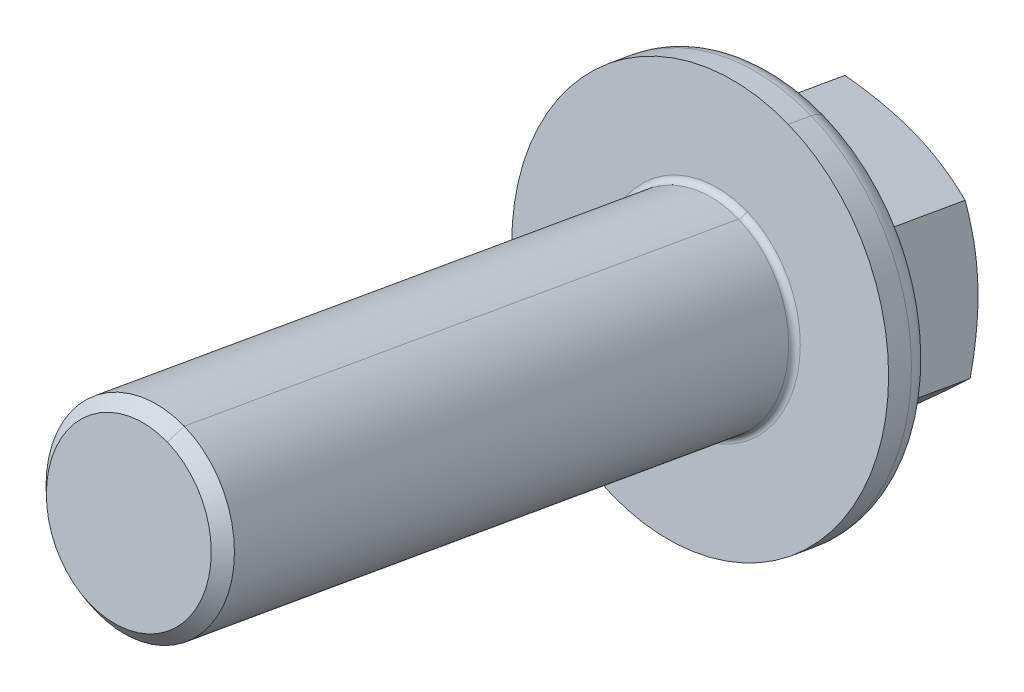
ISO-10303-21;
HEADER;
FILE_DESCRIPTION(('STEP AP214'),'2;1');
FILE_NAME('part.step','',(''),(''),'','','');
FILE_SCHEMA(('AUTOMOTIVE_DESIGN { 1 0 10303 214 1 1 1 1 }'));
ENDSEC;
DATA;
#1=APPLICATION_CONTEXT('core data for automotive mechanical design processes');
#2=APPLICATION_PROTOCOL_DEFINITION('international standard','automotive_design',2000,#1);
#3=PRODUCT_CONTEXT('',#1,'mechanical');
#4=PRODUCT('Part','Part','',(#3));
#5=PRODUCT_RELATED_PRODUCT_CATEGORY('part','',(#4));
#6=PRODUCT_DEFINITION_FORMATION('','',#4);
#7=PRODUCT_DEFINITION_CONTEXT('part definition',#1,'design');
#8=PRODUCT_DEFINITION('design','',#6,#7);
#9=PRODUCT_DEFINITION_SHAPE('','',#8);
#10=(LENGTH_UNIT() NAMED_UNIT(*) SI_UNIT(.MILLI.,.METRE.));
#11=(NAMED_UNIT(*) PLANE_ANGLE_UNIT() SI_UNIT($,.RADIAN.));
#12=(NAMED_UNIT(*) SI_UNIT($,.STERADIAN.) SOLID_ANGLE_UNIT());
#13=UNCERTAINTY_MEASURE_WITH_UNIT(LENGTH_MEASURE(1.E-05),#10,'distance_accuracy_value','');
#14=(GEOMETRIC_REPRESENTATION_CONTEXT(3) GLOBAL_UNCERTAINTY_ASSIGNED_CONTEXT((#13)) GLOBAL_UNIT_ASSIGNED_CONTEXT((#10,
#11,#12)) REPRESENTATION_CONTEXT('',''));
#15=CARTESIAN_POINT('',(0.,0.,0.));
#16=DIRECTION('',(0.,0.,1.));
#17=DIRECTION('',(1.,0.,0.));
#18=AXIS2_PLACEMENT_3D('',#15,#16,#17);
#19=CARTESIAN_POINT('',(49.998122241235,146.357522966761,-143.045914485197));
#20=DIRECTION('',(0.,-0.173648177667837,-0.984807753012048));
#21=DIRECTION('',(0.950853837155076,-0.304935953375422,0.0537684359684349));
#22=AXIS2_PLACEMENT_3D('',#19,#20,#21);
#23=TOROIDAL_SURFACE('',#22,4.25,0.25);
#24=CARTESIAN_POINT('',(49.998122241235,146.314110922344,-143.29211642345));
#25=DIRECTION('',(0.,0.173648177667837,0.984807753012048));
#26=DIRECTION('',(-0.950853837155076,0.304935953375421,-0.0537684359684347));
#27=AXIS2_PLACEMENT_3D('',#24,#25,#26);
#28=CIRCLE('',#27,4.25);
#29=CARTESIAN_POINT('',(51.3140925896424,150.293845903293,-143.993851076665));
#30=VERTEX_POINT('',#29);
#31=CARTESIAN_POINT('',(48.6821518928276,142.334375941394,-142.590381770236));
#32=VERTEX_POINT('',#31);
#33=EDGE_CURVE('E11',#30,#32,#28,.T.);
#34=ORIENTED_EDGE('',*,*,#33,.T.);
#35=CARTESIAN_POINT('',(48.6821518928276,142.377787985811,-142.344179831983));
#36=DIRECTION('',(0.950853837155076,-0.304935953375421,0.0537684359684348));
#37=DIRECTION('',(0.,-0.173648177667854,-0.984807753012045));
#38=AXIS2_PLACEMENT_3D('',#35,#36,#37);
#39=CIRCLE('',#38,0.25);
#40=CARTESIAN_POINT('',(48.7595619133222,142.611890043514,-142.385458340996));
#41=VERTEX_POINT('',#40);
#42=EDGE_CURVE('E33',#32,#41,#39,.T.);
#43=ORIENTED_EDGE('',*,*,#42,.T.);
#44=CARTESIAN_POINT('',(49.998122241235,146.357522966761,-143.045914485197));
#45=DIRECTION('',(0.,0.173648177667837,0.984807753012048));
#46=DIRECTION('',(-0.950853837155076,0.30493595337542,-0.0537684359684346));
#47=AXIS2_PLACEMENT_3D('',#44,#45,#46);
#48=CIRCLE('',#47,4.);
#49=CARTESIAN_POINT('',(51.2366825691478,150.103155890007,-143.706370629399));
#50=VERTEX_POINT('',#49);
#51=EDGE_CURVE('E461',#50,#41,#48,.T.);
#52=ORIENTED_EDGE('',*,*,#51,.F.);
#53=CARTESIAN_POINT('',(51.3140925896424,150.33725794771,-143.747649138412));
#54=DIRECTION('',(-0.950853837155076,0.304935953375422,-0.0537684359684348));
#55=DIRECTION('',(0.,-0.173648177667854,-0.984807753012045));
#56=AXIS2_PLACEMENT_3D('',#53,#54,#55);
#57=CIRCLE('',#56,0.25);
#58=EDGE_CURVE('E457',#30,#50,#57,.T.);
#59=ORIENTED_EDGE('',*,*,#58,.F.);
#60=EDGE_LOOP('',(#34,#43,#52,#59));
#61=FACE_BOUND('',#60,.T.);
#62=ADVANCED_FACE('F17',(#61),#23,.F.);
#63=CARTESIAN_POINT('',(49.998122241235,146.357522966761,-143.045914485197));
#64=DIRECTION('',(0.,-0.173648177667837,-0.984807753012048));
#65=DIRECTION('',(-0.309640081978204,-0.936408230811574,0.165114036050449));
#66=AXIS2_PLACEMENT_3D('',#63,#64,#65);
#67=TOROIDAL_SURFACE('',#66,4.25,0.25);
#68=CARTESIAN_POINT('',(49.998122241235,146.314110922344,-143.29211642345));
#69=DIRECTION('',(0.,0.173648177667837,0.984807753012048));
#70=DIRECTION('',(-0.950853837155076,0.304935953375421,-0.0537684359684347));
#71=AXIS2_PLACEMENT_3D('',#68,#69,#70);
#72=CIRCLE('',#71,4.25);
#73=EDGE_CURVE('E454',#32,#30,#72,.T.);
#74=ORIENTED_EDGE('',*,*,#73,.T.);
#75=ORIENTED_EDGE('',*,*,#58,.T.);
#76=CARTESIAN_POINT('',(49.998122241235,146.357522966761,-143.045914485197));
#77=DIRECTION('',(0.,0.173648177667837,0.984807753012048));
#78=DIRECTION('',(-0.950853837155076,0.30493595337542,-0.0537684359684346));
#79=AXIS2_PLACEMENT_3D('',#76,#77,#78);
#80=CIRCLE('',#79,4.);
#81=EDGE_CURVE('E465',#41,#50,#80,.T.);
#82=ORIENTED_EDGE('',*,*,#81,.F.);
#83=ORIENTED_EDGE('',*,*,#42,.F.);
#84=EDGE_LOOP('',(#74,#75,#82,#83));
#85=FACE_BOUND('',#84,.T.);
#86=ADVANCED_FACE('F311',(#85),#67,.F.);
#87=CARTESIAN_POINT('',(49.998122241235,148.484713143191,-130.9820195108));
#88=DIRECTION('',(0.,-0.173648177667837,-0.984807753012048));
#89=DIRECTION('',(0.950853837155076,-0.30493595337542,0.0537684359684346));
#90=AXIS2_PLACEMENT_3D('',#87,#88,#89);
#91=CYLINDRICAL_SURFACE('',#90,4.);
#92=DIRECTION('',(0.,0.173648177667837,0.984807753012048));
#93=VECTOR('',#92,1.);
#94=CARTESIAN_POINT('',(51.2366825691478,152.230346066438,-131.642475655002));
#95=LINE('',#94,#93);
#96=CARTESIAN_POINT('',(51.2366825691478,154.314124198452,-119.824782618857));
#97=VERTEX_POINT('',#96);
#98=EDGE_CURVE('E468',#50,#97,#95,.T.);
#99=ORIENTED_EDGE('',*,*,#98,.F.);
#100=ORIENTED_EDGE('',*,*,#51,.T.);
#101=DIRECTION('',(0.,0.173648177667837,0.984807753012048));
#102=VECTOR('',#101,1.);
#103=CARTESIAN_POINT('',(48.7595619133222,144.739080219945,-130.321563366598));
#104=LINE('',#103,#102);
#105=CARTESIAN_POINT('',(48.7595619133222,146.822858351959,-118.503870330453));
#106=VERTEX_POINT('',#105);
#107=EDGE_CURVE('E472',#41,#106,#104,.T.);
#108=ORIENTED_EDGE('',*,*,#107,.T.);
#109=CARTESIAN_POINT('',(49.998122241235,150.568491275206,-119.164326474655));
#110=DIRECTION('',(0.,-0.173648177667837,-0.984807753012048));
#111=DIRECTION('',(-0.950853837155076,0.30493595337542,-0.0537684359684345));
#112=AXIS2_PLACEMENT_3D('',#109,#110,#111);
#113=CIRCLE('',#112,4.);
#114=EDGE_CURVE('E467',#106,#97,#113,.T.);
#115=ORIENTED_EDGE('',*,*,#114,.T.);
#116=EDGE_LOOP('',(#99,#100,#108,#115));
#117=FACE_BOUND('',#116,.T.);
#118=ADVANCED_FACE('F317',(#117),#91,.T.);
#119=CARTESIAN_POINT('',(49.998122241235,148.484713143191,-130.9820195108));
#120=DIRECTION('',(0.,-0.173648177667837,-0.984807753012048));
#121=DIRECTION('',(0.950853837155076,-0.30493595337542,0.0537684359684346));
#122=AXIS2_PLACEMENT_3D('',#119,#120,#121);
#123=CYLINDRICAL_SURFACE('',#122,4.);
#124=ORIENTED_EDGE('',*,*,#107,.F.);
#125=ORIENTED_EDGE('',*,*,#81,.T.);
#126=ORIENTED_EDGE('',*,*,#98,.T.);
#127=CARTESIAN_POINT('',(49.998122241235,150.568491275206,-119.164326474655));
#128=DIRECTION('',(0.,-0.173648177667837,-0.984807753012048));
#129=DIRECTION('',(-0.950853837155076,0.30493595337542,-0.0537684359684345));
#130=AXIS2_PLACEMENT_3D('',#127,#128,#129);
#131=CIRCLE('',#130,4.);
#132=EDGE_CURVE('E471',#97,#106,#131,.T.);
#133=ORIENTED_EDGE('',*,*,#132,.T.);
#134=EDGE_LOOP('',(#124,#125,#126,#133));
#135=FACE_BOUND('',#134,.T.);
#136=ADVANCED_FACE('F322',(#135),#123,.T.);
#137=CARTESIAN_POINT('',(49.9981222412351,151.263083985877,-115.225095462607));
#138=DIRECTION('',(0.,-0.173648177667833,-0.984807753012049));
#139=DIRECTION('',(-0.0369243923365254,-0.984136175286614,0.173529760395196));
#140=AXIS2_PLACEMENT_3D('',#137,#138,#139);
#141=CONICAL_SURFACE('',#140,0.,0.785398163396999);
#142=DIRECTION('',(0.218948438976632,0.784928466118314,0.579610976558283));
#143=VECTOR('',#142,1.);
#144=CARTESIAN_POINT('',(48.8369727967557,147.100372177337,-118.298946852416));
#145=LINE('',#144,#143);
#146=CARTESIAN_POINT('',(48.9143822034284,147.377886476308,-118.094023457886));
#147=VERTEX_POINT('',#146);
#148=EDGE_CURVE('E478',#106,#147,#145,.T.);
#149=ORIENTED_EDGE('',*,*,#148,.T.);
#150=CARTESIAN_POINT('',(49.998122241235,150.65531536404,-118.671922598149));
#151=DIRECTION('',(0.,-0.173648177667837,-0.984807753012048));
#152=DIRECTION('',(0.999318062105632,-0.036363427848566,0.00641185344076513));
#153=AXIS2_PLACEMENT_3D('',#150,#151,#152);
#154=CIRCLE('',#153,3.5);
#155=CARTESIAN_POINT('',(51.0818625281587,153.93274417188,-119.249821724326));
#156=VERTEX_POINT('',#155);
#157=EDGE_CURVE('E481',#147,#156,#154,.T.);
#158=ORIENTED_EDGE('',*,*,#157,.T.);
#159=DIRECTION('',(-0.218948601693932,-0.539352805996153,0.813117494880259));
#160=VECTOR('',#159,1.);
#161=CARTESIAN_POINT('',(51.1592725486533,154.123434185166,-119.537302171591));
#162=LINE('',#161,#160);
#163=EDGE_CURVE('E484',#97,#156,#162,.T.);
#164=ORIENTED_EDGE('',*,*,#163,.F.);
#165=ORIENTED_EDGE('',*,*,#114,.F.);
#166=EDGE_LOOP('',(#149,#158,#164,#165));
#167=FACE_BOUND('',#166,.T.);
#168=ADVANCED_FACE('F326',(#167),#141,.T.);
#169=CARTESIAN_POINT('',(49.9981222412359,151.263083985876,-115.225095462607));
#170=DIRECTION('',(-2.29886375447954E-13,-0.173648177667559,-0.984807753012097));
#171=DIRECTION('',(0.309640081978204,0.936408230811608,-0.165114036050255));
#172=AXIS2_PLACEMENT_3D('',#169,#170,#171);
#173=CONICAL_SURFACE('',#172,0.,0.785398163396999);
#174=ORIENTED_EDGE('',*,*,#163,.T.);
#175=CARTESIAN_POINT('',(49.9981222412351,150.655315364039,-118.67192259815));
#176=DIRECTION('',(-2.90939847236384E-13,-0.173648177667744,-0.984807753012065));
#177=DIRECTION('',(0.950853837155077,-0.304935953375472,0.0537684359681331));
#178=AXIS2_PLACEMENT_3D('',#175,#176,#177);
#179=CIRCLE('',#178,3.5);
#180=EDGE_CURVE('E352',#156,#147,#179,.T.);
#181=ORIENTED_EDGE('',*,*,#180,.T.);
#182=ORIENTED_EDGE('',*,*,#148,.F.);
#183=ORIENTED_EDGE('',*,*,#132,.F.);
#184=EDGE_LOOP('',(#174,#181,#182,#183));
#185=FACE_BOUND('',#184,.T.);
#186=ADVANCED_FACE('F330',(#185),#173,.T.);
#187=CARTESIAN_POINT('',(49.998122241235,150.65531536404,-118.671922598149));
#188=DIRECTION('',(0.,-0.173648177667837,-0.984807753012048));
#189=DIRECTION('',(-0.309640081978204,-0.936408230811574,0.165114036050449));
#190=AXIS2_PLACEMENT_3D('',#187,#188,#189);
#191=PLANE('',#190);
#192=ORIENTED_EDGE('',*,*,#180,.F.);
#193=ORIENTED_EDGE('',*,*,#157,.F.);
#194=EDGE_LOOP('',(#192,#193));
#195=FACE_BOUND('',#194,.T.);
#196=ADVANCED_FACE('F334',(#195),#191,.F.);
#197=CARTESIAN_POINT('',(49.998122241235,145.098573678669,-150.185770694534));
#198=DIRECTION('',(0.,-0.173648177667837,-0.984807753012048));
#199=DIRECTION('',(0.950853837155076,-0.304935953375421,0.0537684359684347));
#200=AXIS2_PLACEMENT_3D('',#197,#198,#199);
#201=PLANE('',#200);
#202=CARTESIAN_POINT('',(49.998122241235,145.098573678669,-150.185770694534));
#203=DIRECTION('',(0.,-0.173648177667837,-0.984807753012048));
#204=DIRECTION('',(-0.950853837155075,0.304935953375424,-0.0537684359684351));
#205=AXIS2_PLACEMENT_3D('',#202,#203,#204);
#206=CIRCLE('',#205,5.);
#207=CARTESIAN_POINT('',(54.8895403374926,146.119182844947,-150.365731627307));
#208=VERTEX_POINT('',#207);
#209=CARTESIAN_POINT('',(53.3413399276004,141.437141690886,-149.540161447054));
#210=VERTEX_POINT('',#209);
#211=EDGE_CURVE('E347',#208,#210,#206,.T.);
#212=ORIENTED_EDGE('',*,*,#211,.T.);
#213=CARTESIAN_POINT('',(49.998122241235,145.098573678669,-150.185770694534));
#214=DIRECTION('',(0.,-0.173648177667837,-0.984807753012048));
#215=DIRECTION('',(-0.950853837155075,0.304935953375424,-0.0537684359684351));
#216=AXIS2_PLACEMENT_3D('',#213,#214,#215);
#217=CIRCLE('',#216,5.);
#218=CARTESIAN_POINT('',(48.4499218313441,140.416532524611,-149.360200514282));
#219=VERTEX_POINT('',#218);
#220=EDGE_CURVE('E353',#210,#219,#217,.T.);
#221=ORIENTED_EDGE('',*,*,#220,.T.);
#222=CARTESIAN_POINT('',(49.998122241235,145.098573678669,-150.185770694534));
#223=DIRECTION('',(0.,-0.173648177667837,-0.984807753012048));
#224=DIRECTION('',(-0.950853837155075,0.304935953375424,-0.0537684359684351));
#225=AXIS2_PLACEMENT_3D('',#222,#223,#224);
#226=CIRCLE('',#225,5.);
#227=CARTESIAN_POINT('',(46.3601304941449,141.72066642625,-149.590154507599));
#228=VERTEX_POINT('',#227);
#229=EDGE_CURVE('E368',#219,#228,#226,.T.);
#230=ORIENTED_EDGE('',*,*,#229,.T.);
#231=CARTESIAN_POINT('',(49.998122241235,145.098573678669,-150.185770694534));
#232=DIRECTION('',(0.,-0.173648177667837,-0.984807753012048));
#233=DIRECTION('',(-0.950853837155075,0.304935953375424,-0.0537684359684351));
#234=AXIS2_PLACEMENT_3D('',#231,#232,#233);
#235=CIRCLE('',#234,5.);
#236=CARTESIAN_POINT('',(45.1067041449777,144.07796451239,-150.005809761759));
#237=VERTEX_POINT('',#236);
#238=EDGE_CURVE('E372',#228,#237,#235,.T.);
#239=ORIENTED_EDGE('',*,*,#238,.T.);
#240=CARTESIAN_POINT('',(49.998122241235,145.098573678669,-150.185770694534));
#241=DIRECTION('',(0.,-0.173648177667837,-0.984807753012048));
#242=DIRECTION('',(-0.950853837155075,0.304935953375424,-0.0537684359684351));
#243=AXIS2_PLACEMENT_3D('',#240,#241,#242);
#244=CIRCLE('',#243,5.);
#245=CARTESIAN_POINT('',(46.6549045548693,148.760005666451,-150.831379942012));
#246=VERTEX_POINT('',#245);
#247=EDGE_CURVE('E172',#237,#246,#244,.T.);
#248=ORIENTED_EDGE('',*,*,#247,.T.);
#249=CARTESIAN_POINT('',(49.998122241235,145.098573678669,-150.185770694534));
#250=DIRECTION('',(0.,-0.173648177667837,-0.984807753012048));
#251=DIRECTION('',(-0.950853837155075,0.304935953375424,-0.0537684359684351));
#252=AXIS2_PLACEMENT_3D('',#249,#250,#251);
#253=CIRCLE('',#252,5.);
#254=CARTESIAN_POINT('',(51.546322651126,149.780614832727,-151.011340874786));
#255=VERTEX_POINT('',#254);
#256=EDGE_CURVE('E147',#246,#255,#253,.T.);
#257=ORIENTED_EDGE('',*,*,#256,.T.);
#258=CARTESIAN_POINT('',(49.998122241235,145.098573678669,-150.185770694534));
#259=DIRECTION('',(0.,-0.173648177667837,-0.984807753012048));
#260=DIRECTION('',(-0.950853837155075,0.304935953375424,-0.0537684359684351));
#261=AXIS2_PLACEMENT_3D('',#258,#259,#260);
#262=CIRCLE('',#261,5.);
#263=CARTESIAN_POINT('',(53.6361139883251,148.476480931088,-150.78138688147));
#264=VERTEX_POINT('',#263);
#265=EDGE_CURVE('E160',#255,#264,#262,.T.);
#266=ORIENTED_EDGE('',*,*,#265,.T.);
#267=CARTESIAN_POINT('',(49.998122241235,145.098573678669,-150.185770694534));
#268=DIRECTION('',(0.,-0.173648177667837,-0.984807753012048));
#269=DIRECTION('',(-0.950853837155075,0.304935953375424,-0.0537684359684351));
#270=AXIS2_PLACEMENT_3D('',#267,#268,#269);
#271=CIRCLE('',#270,5.);
#272=EDGE_CURVE('E166',#264,#208,#271,.T.);
#273=ORIENTED_EDGE('',*,*,#272,.T.);
#274=EDGE_LOOP('',(#212,#221,#230,#239,#248,#257,#266,#273));
#275=FACE_BOUND('',#274,.T.);
#276=ADVANCED_FACE('F169',(#275),#201,.T.);
#277=CARTESIAN_POINT('',(49.998122241235,145.098573678669,-150.185770694534));
#278=DIRECTION('',(0.,0.173648177667837,0.984807753012048));
#279=DIRECTION('',(0.727598349418324,0.675581450484054,-0.11912323738714));
#280=AXIS2_PLACEMENT_3D('',#277,#278,#279);
#281=CONICAL_SURFACE('',#280,5.,1.0471975512);
#282=ORIENTED_EDGE('',*,*,#211,.F.);
#283=CARTESIAN_POINT('',(55.4878794296533,143.415573279286,-149.435541081199));
#284=CARTESIAN_POINT('',(55.4391748824888,143.630176304098,-149.542278075946));
#285=CARTESIAN_POINT('',(55.3900802918084,143.84757993513,-149.643733599582));
#286=CARTESIAN_POINT('',(55.2914583464846,144.286951808943,-149.832520163997));
#287=CARTESIAN_POINT('',(55.2419344318635,144.508891437683,-149.919919981723));
#288=CARTESIAN_POINT('',(55.1671811743695,144.846219825367,-150.038662375499));
#289=CARTESIAN_POINT('',(55.1421689925106,144.959474723572,-150.076204144338));
#290=CARTESIAN_POINT('',(55.0920248852829,145.187349376973,-150.146801875159));
#291=CARTESIAN_POINT('',(55.0668929630833,145.301969096166,-150.179857955192));
#292=CARTESIAN_POINT('',(55.0164164153042,145.533044077326,-150.241341607244));
#293=CARTESIAN_POINT('',(54.9910713552905,145.649505665294,-150.269745110845));
#294=CARTESIAN_POINT('',(54.9403313897386,145.883550894626,-150.321543460521));
#295=CARTESIAN_POINT('',(54.9149364753252,146.001134753577,-150.344937313831));
#296=CARTESIAN_POINT('',(54.8895403374938,146.119182844947,-150.365731627307));
#297=B_SPLINE_CURVE_WITH_KNOTS('',3,(#283,#284,#285,#286,#287,#288,#289,#290,#291,#292,#293,
#294,#295,#296),.UNSPECIFIED.,.F.,.F.,(4,2,2,2,2,2,4),(0.,0.734036658391423,1.46436443241669,
1.83000749078334,2.19564092445815,2.56310985866669,2.9306515471674),.UNSPECIFIED.);
#298=CARTESIAN_POINT('',(55.4878794296539,143.415573279287,-149.435541081199));
#299=VERTEX_POINT('',#298);
#300=EDGE_CURVE('E218',#299,#208,#297,.T.);
#301=ORIENTED_EDGE('',*,*,#300,.F.);
#302=CARTESIAN_POINT('',(53.3413399276015,141.437141690885,-149.540161447053));
#303=CARTESIAN_POINT('',(53.4324484875621,141.517819980658,-149.554407956351));
#304=CARTESIAN_POINT('',(53.5235526585145,141.598952929526,-149.56605323778));
#305=CARTESIAN_POINT('',(53.7055821160863,141.76195113256,-149.584264357744));
#306=CARTESIAN_POINT('',(53.7965074345459,141.843816238587,-149.59083120129));
#307=CARTESIAN_POINT('',(53.9775918817345,142.007723429098,-149.598993563003));
#308=CARTESIAN_POINT('',(54.067752568995,142.089762587056,-149.600613749007));
#309=CARTESIAN_POINT('',(54.2476443868121,142.254268737032,-149.599203340534));
#310=CARTESIAN_POINT('',(54.3373755059988,142.336735740256,-149.596172623632));
#311=CARTESIAN_POINT('',(54.6055525685049,142.584356309733,-149.580572513342));
#312=CARTESIAN_POINT('',(54.7832194474093,142.749944438086,-149.561504294965));
#313=CARTESIAN_POINT('',(55.1370253480783,143.082295509926,-149.508793307502));
#314=CARTESIAN_POINT('',(55.3131520287741,143.24906014906,-149.475077015028));
#315=CARTESIAN_POINT('',(55.4878794296545,143.415573279288,-149.435541081199));
#316=B_SPLINE_CURVE_WITH_KNOTS('',3,(#302,#303,#304,#305,#306,#307,#308,#309,#310,#311,#312,
#313,#314,#315),.UNSPECIFIED.,.F.,.F.,(4,2,2,2,2,2,4),(0.,0.367541688500857,0.735010622709555,
1.10064405638448,1.46628711475125,2.19661488877674,2.93065154716842),.UNSPECIFIED.);
#317=EDGE_CURVE('E234',#210,#299,#316,.T.);
#318=ORIENTED_EDGE('',*,*,#317,.F.);
#319=EDGE_LOOP('',(#282,#301,#318));
#320=FACE_BOUND('',#319,.T.);
#321=ADVANCED_FACE('F248',(#320),#281,.T.);
#322=CARTESIAN_POINT('',(49.998122241235,145.098573678669,-150.185770694534));
#323=DIRECTION('',(0.,0.173648177667837,0.984807753012048));
#324=DIRECTION('',(0.727598349418324,0.675581450484054,-0.11912323738714));
#325=AXIS2_PLACEMENT_3D('',#322,#323,#324);
#326=CONICAL_SURFACE('',#325,5.,1.0471975512);
#327=ORIENTED_EDGE('',*,*,#220,.F.);
#328=CARTESIAN_POINT('',(51.194800425553,139.613806399063,-148.76518700585));
#329=CARTESIAN_POINT('',(51.369527826433,139.756755473047,-148.859289475791));
#330=CARTESIAN_POINT('',(51.5456545071284,139.901931322665,-148.948009292807));
#331=CARTESIAN_POINT('',(51.8994604077967,140.196210952895,-149.111212179986));
#332=CARTESIAN_POINT('',(52.0771272867007,140.345291180416,-149.185764919478));
#333=CARTESIAN_POINT('',(52.3453043492062,140.572642850349,-149.285115450664));
#334=CARTESIAN_POINT('',(52.4350354683927,140.649099918508,-149.316168769235));
#335=CARTESIAN_POINT('',(52.6149272862094,140.803202745606,-149.373758536662));
#336=CARTESIAN_POINT('',(52.7050879734697,140.880848473204,-149.400295104393));
#337=CARTESIAN_POINT('',(52.886172420658,141.037662542743,-149.448684554114));
#338=CARTESIAN_POINT('',(52.9770977391173,141.116836571548,-149.470513254989));
#339=CARTESIAN_POINT('',(53.1591271966888,141.276233349999,-149.509149068707));
#340=CARTESIAN_POINT('',(53.250231367641,141.356456304177,-149.525955186481));
#341=CARTESIAN_POINT('',(53.3413399276015,141.437141690885,-149.540161447053));
#342=B_SPLINE_CURVE_WITH_KNOTS('',3,(#328,#329,#330,#331,#332,#333,#334,#335,#336,#337,#338,
#339,#340,#341),.UNSPECIFIED.,.F.,.F.,(4,2,2,2,2,2,4),(0.,0.734036658390082,1.46436443241398,
1.83000749077993,2.19564092445406,2.56310985866195,2.93065154716203),.UNSPECIFIED.);
#343=CARTESIAN_POINT('',(51.1948004255538,139.613806399064,-148.76518700585));
#344=VERTEX_POINT('',#343);
#345=EDGE_CURVE('E225',#344,#210,#342,.T.);
#346=ORIENTED_EDGE('',*,*,#345,.F.);
#347=CARTESIAN_POINT('',(48.4499218313441,140.416532524611,-149.360200514282));
#348=CARTESIAN_POINT('',(48.5664265291361,140.379166271482,-149.353632585741));
#349=CARTESIAN_POINT('',(48.6829256145018,140.342260364054,-149.344464432033));
#350=CARTESIAN_POINT('',(48.9156950376253,140.269412625465,-149.321089549197));
#351=CARTESIAN_POINT('',(49.0319654160985,140.233470604912,-149.306883817807));
#352=CARTESIAN_POINT('',(49.2635264110661,140.162756253777,-149.273676071472));
#353=CARTESIAN_POINT('',(49.3788190205261,140.127978977363,-149.254698368306));
#354=CARTESIAN_POINT('',(49.6088549455707,140.059408812499,-149.212190316963));
#355=CARTESIAN_POINT('',(49.7235982466163,140.025615949986,-149.188659848958));
#356=CARTESIAN_POINT('',(50.066528566616,139.925773682007,-149.11179266563));
#357=CARTESIAN_POINT('',(50.2937193601413,139.861168231204,-149.052135108463));
#358=CARTESIAN_POINT('',(50.7461472061338,139.735111708426,-148.918594493906));
#359=CARTESIAN_POINT('',(50.9713684775098,139.67367832177,-148.844640732541));
#360=CARTESIAN_POINT('',(51.1948004255545,139.613806399064,-148.76518700585));
#361=B_SPLINE_CURVE_WITH_KNOTS('',3,(#347,#348,#349,#350,#351,#352,#353,#354,#355,#356,#357,
#358,#359,#360),.UNSPECIFIED.,.F.,.F.,(4,2,2,2,2,2,4),(0.,0.36754168850069,0.735010622709175,
1.10064405638397,1.46628711475054,2.19661488877568,2.930651547167),.UNSPECIFIED.);
#362=EDGE_CURVE('E256',#219,#344,#361,.T.);
#363=ORIENTED_EDGE('',*,*,#362,.F.);
#364=EDGE_LOOP('',(#327,#346,#363));
#365=FACE_BOUND('',#364,.T.);
#366=ADVANCED_FACE('F243',(#365),#326,.T.);
#367=CARTESIAN_POINT('',(49.998122241235,145.098573678669,-150.185770694534));
#368=DIRECTION('',(0.,0.173648177667837,0.984807753012048));
#369=DIRECTION('',(0.727598349418324,0.675581450484054,-0.11912323738714));
#370=AXIS2_PLACEMENT_3D('',#367,#368,#369);
#371=CONICAL_SURFACE('',#370,5.,1.0471975512);
#372=DIRECTION('',(0.630118654347753,0.49824660961079,-0.595567626264499));
#373=VECTOR('',#372,1.);
#374=CARTESIAN_POINT('',(44.7368460928394,140.437105078229,-148.055878969265));
#375=LINE('',#374,#373);
#376=CARTESIAN_POINT('',(45.8526527377652,141.319394269292,-149.110503063145));
#377=VERTEX_POINT('',#376);
#378=EDGE_CURVE('E359',#377,#228,#375,.T.);
#379=ORIENTED_EDGE('',*,*,#378,.T.);
#380=ORIENTED_EDGE('',*,*,#229,.F.);
#381=CARTESIAN_POINT('',(45.8526527377646,141.319394269295,-149.110503063129));
#382=CARTESIAN_POINT('',(46.0644357983107,141.240765765312,-149.159268475625));
#383=CARTESIAN_POINT('',(46.2778240206991,141.162557079677,-149.202642803138));
#384=CARTESIAN_POINT('',(46.7063596997772,141.00792932147,-149.275942947605));
#385=CARTESIAN_POINT('',(46.9214943172372,140.931503605573,-149.305930518277));
#386=CARTESIAN_POINT('',(47.2460346538946,140.818319847472,-149.339213613791));
#387=CARTESIAN_POINT('',(47.3545818044383,140.780814026044,-149.348360088141));
#388=CARTESIAN_POINT('',(47.572146248573,140.706380997244,-149.362489889284));
#389=CARTESIAN_POINT('',(47.6811635332149,140.669453778919,-149.367473294974));
#390=CARTESIAN_POINT('',(47.9000400707925,140.596089853949,-149.373079324417));
#391=CARTESIAN_POINT('',(48.0099008840012,140.559656215164,-149.373681623476));
#392=CARTESIAN_POINT('',(48.2298136331932,140.487523424747,-149.370362323418));
#393=CARTESIAN_POINT('',(48.3398655966701,140.451824390258,-149.366440008384));
#394=CARTESIAN_POINT('',(48.4499218313441,140.416532524611,-149.360200514282));
#395=B_SPLINE_CURVE_WITH_KNOTS('',3,(#381,#382,#383,#384,#385,#386,#387,#388,#389,#390,#391,
#392,#393,#394),.UNSPECIFIED.,.F.,.F.,(4,2,2,2,2,2,4),(0.,0.693572709725118,1.38391201165248,
1.72946469135565,2.07501082206913,2.42215898329262,2.7693620802703),.UNSPECIFIED.);
#396=EDGE_CURVE('E262',#377,#219,#395,.T.);
#397=ORIENTED_EDGE('',*,*,#396,.F.);
#398=EDGE_LOOP('',(#379,#380,#397));
#399=FACE_BOUND('',#398,.T.);
#400=ADVANCED_FACE('F247',(#399),#371,.T.);
#401=CARTESIAN_POINT('',(49.998122241235,145.098573678669,-150.185770694534));
#402=DIRECTION('',(0.,0.173648177667837,0.984807753012048));
#403=DIRECTION('',(0.727598349418324,0.675581450484054,-0.11912323738714));
#404=AXIS2_PLACEMENT_3D('',#401,#402,#403);
#405=CONICAL_SURFACE('',#404,5.,1.0471975512);
#406=ORIENTED_EDGE('',*,*,#238,.F.);
#407=ORIENTED_EDGE('',*,*,#378,.F.);
#408=CARTESIAN_POINT('',(45.8526527377663,141.319394269302,-149.110503063083));
#409=CARTESIAN_POINT('',(45.8040875345662,141.337423930787,-149.09932660615));
#410=CARTESIAN_POINT('',(45.7549017335225,141.355736995474,-149.087706703428));
#411=CARTESIAN_POINT('',(45.7050432371349,141.374354946737,-149.075619215637));
#412=B_SPLINE_CURVE_WITH_KNOTS('',3,(#408,#409,#410,#411),.UNSPECIFIED.,.F.,.F.,(4,4),(0.,1.),.UNSPECIFIED.);
#413=CARTESIAN_POINT('',(45.7050432371354,141.374354946733,-149.075619215644));
#414=VERTEX_POINT('',#413);
#415=EDGE_CURVE('E362',#377,#414,#412,.T.);
#416=ORIENTED_EDGE('',*,*,#415,.T.);
#417=CARTESIAN_POINT('',(45.1067041449767,144.07796451239,-150.005809761758));
#418=CARTESIAN_POINT('',(45.1321002828081,143.95991642102,-149.985015448282));
#419=CARTESIAN_POINT('',(45.1574951972215,143.842332562069,-149.961621594972));
#420=CARTESIAN_POINT('',(45.2082351627733,143.608287332737,-149.909823245296));
#421=CARTESIAN_POINT('',(45.233580222787,143.491825744769,-149.881419741696));
#422=CARTESIAN_POINT('',(45.2840567705661,143.260750763609,-149.819936089644));
#423=CARTESIAN_POINT('',(45.3091886927657,143.146131044416,-149.78688000961));
#424=CARTESIAN_POINT('',(45.3593327999934,142.918256391015,-149.71628227879));
#425=CARTESIAN_POINT('',(45.3843449818523,142.80500149281,-149.678740509951));
#426=CARTESIAN_POINT('',(45.4590982393462,142.467673105127,-149.559998116175));
#427=CARTESIAN_POINT('',(45.5086221539673,142.245733476386,-149.472598298449));
#428=CARTESIAN_POINT('',(45.6072440992911,141.806361602574,-149.283811734034));
#429=CARTESIAN_POINT('',(45.6563386899715,141.588957971542,-149.182356210398));
#430=CARTESIAN_POINT('',(45.705043237136,141.37435494673,-149.075619215651));
#431=B_SPLINE_CURVE_WITH_KNOTS('',3,(#417,#418,#419,#420,#421,#422,#423,#424,#425,#426,#427,
#428,#429,#430),.UNSPECIFIED.,.F.,.F.,(4,2,2,2,2,2,4),(0.,0.367541688500546,0.735010622708973,
1.10064405638359,1.46628711475008,2.196614888775,2.93065154716609),.UNSPECIFIED.);
#432=EDGE_CURVE('E287',#237,#414,#431,.T.);
#433=ORIENTED_EDGE('',*,*,#432,.F.);
#434=EDGE_LOOP('',(#406,#407,#416,#433));
#435=FACE_BOUND('',#434,.T.);
#436=ADVANCED_FACE('F297',(#435),#405,.T.);
#437=CARTESIAN_POINT('',(49.998122241235,145.098573678669,-150.185770694534));
#438=DIRECTION('',(0.,0.173648177667837,0.984807753012048));
#439=DIRECTION('',(0.727598349418324,0.675581450484054,-0.11912323738714));
#440=AXIS2_PLACEMENT_3D('',#437,#438,#439);
#441=CONICAL_SURFACE('',#440,5.,1.0471975512);
#442=ORIENTED_EDGE('',*,*,#247,.F.);
#443=CARTESIAN_POINT('',(44.508365052817,146.936670374628,-150.056405500806));
#444=CARTESIAN_POINT('',(44.5570695999815,146.698503293573,-150.08330690983));
#445=CARTESIAN_POINT('',(44.6061641906619,146.459510873024,-150.104287495683));
#446=CARTESIAN_POINT('',(44.7047861359858,145.982067557603,-150.131414805911));
#447=CARTESIAN_POINT('',(44.7543100506069,145.74362002803,-150.137635946054));
#448=CARTESIAN_POINT('',(44.8290633081008,145.386022740804,-150.133844193756));
#449=CARTESIAN_POINT('',(44.8540754899597,145.266757907534,-150.130386460389));
#450=CARTESIAN_POINT('',(44.9042195971875,145.028479931255,-150.118788905468));
#451=CARTESIAN_POINT('',(44.9293515193871,144.909466781702,-150.110649207162));
#452=CARTESIAN_POINT('',(44.9798280671662,144.671298679571,-150.089392643118));
#453=CARTESIAN_POINT('',(45.00517312718,144.552146014379,-150.076250996847));
#454=CARTESIAN_POINT('',(45.0559130927318,144.314499360466,-150.044877340925));
#455=CARTESIAN_POINT('',(45.0813080071452,144.196005506824,-150.026644323961));
#456=CARTESIAN_POINT('',(45.1067041449767,144.07796451239,-150.005809761758));
#457=B_SPLINE_CURVE_WITH_KNOTS('',3,(#443,#444,#445,#446,#447,#448,#449,#450,#451,#452,#453,
#454,#455,#456),.UNSPECIFIED.,.F.,.F.,(4,2,2,2,2,2,4),(0.,0.734036658391505,1.46436443241694,
1.83000749078363,2.19564092445856,2.56310985866719,2.930651547168),.UNSPECIFIED.);
#458=CARTESIAN_POINT('',(44.5083650528164,146.936670374628,-150.056405500805));
#459=VERTEX_POINT('',#458);
#460=EDGE_CURVE('E268',#459,#237,#457,.T.);
#461=ORIENTED_EDGE('',*,*,#460,.F.);
#462=CARTESIAN_POINT('',(46.6549045548684,148.760005666452,-150.831379942011));
#463=CARTESIAN_POINT('',(46.5637959949078,148.679320279744,-150.817173681439));
#464=CARTESIAN_POINT('',(46.4726918239554,148.599097325566,-150.800367563664));
#465=CARTESIAN_POINT('',(46.2906623663835,148.439700547114,-150.761731749947));
#466=CARTESIAN_POINT('',(46.199737047924,148.360526518309,-150.739903049071));
#467=CARTESIAN_POINT('',(46.0186526007354,148.20371244877,-150.69151359935));
#468=CARTESIAN_POINT('',(45.9284919134749,148.126066721172,-150.664977031619));
#469=CARTESIAN_POINT('',(45.7486000956579,147.971963894073,-150.607387264192));
#470=CARTESIAN_POINT('',(45.6588689764711,147.895506825915,-150.576333945622));
#471=CARTESIAN_POINT('',(45.3906919139651,147.668155155981,-150.476983414435));
#472=CARTESIAN_POINT('',(45.2130250350608,147.519074928459,-150.402430674942));
#473=CARTESIAN_POINT('',(44.8592191343919,147.224795298229,-150.239227787763));
#474=CARTESIAN_POINT('',(44.6830924536961,147.079619448611,-150.150507970747));
#475=CARTESIAN_POINT('',(44.5083650528157,146.936670374627,-150.056405500805));
#476=B_SPLINE_CURVE_WITH_KNOTS('',3,(#462,#463,#464,#465,#466,#467,#468,#469,#470,#471,#472,
#473,#474,#475),.UNSPECIFIED.,.F.,.F.,(4,2,2,2,2,2,4),(0.,0.367541688500788,0.735010622709386,
1.10064405638428,1.46628711475097,2.19661488877628,2.93065154716781),.UNSPECIFIED.);
#477=EDGE_CURVE('E188',#246,#459,#476,.T.);
#478=ORIENTED_EDGE('',*,*,#477,.F.);
#479=EDGE_LOOP('',(#442,#461,#478));
#480=FACE_BOUND('',#479,.T.);
#481=ADVANCED_FACE('F300',(#480),#441,.T.);
#482=CARTESIAN_POINT('',(49.998122241235,145.098573678669,-150.185770694534));
#483=DIRECTION('',(0.,0.173648177667837,0.984807753012048));
#484=DIRECTION('',(0.727598349418324,0.675581450484054,-0.11912323738714));
#485=AXIS2_PLACEMENT_3D('',#482,#483,#484);
#486=CONICAL_SURFACE('',#485,5.,1.0471975512);
#487=ORIENTED_EDGE('',*,*,#256,.F.);
#488=CARTESIAN_POINT('',(48.8014440569177,150.738437254852,-150.726759576158));
#489=CARTESIAN_POINT('',(48.6267166560376,150.571924124623,-150.766295509987));
#490=CARTESIAN_POINT('',(48.4505899753421,150.40515948549,-150.80001180246));
#491=CARTESIAN_POINT('',(48.0967840746737,150.072808413651,-150.852722789923));
#492=CARTESIAN_POINT('',(47.9191171957696,149.907220285298,-150.8717910083));
#493=CARTESIAN_POINT('',(47.650940133264,149.659599715822,-150.88739111859));
#494=CARTESIAN_POINT('',(47.5612090140774,149.577132712598,-150.890421835492));
#495=CARTESIAN_POINT('',(47.3813171962607,149.412626562622,-150.891832243964));
#496=CARTESIAN_POINT('',(47.2911565090003,149.330587404664,-150.890212057961));
#497=CARTESIAN_POINT('',(47.110072061812,149.166680214154,-150.882049696247));
#498=CARTESIAN_POINT('',(47.0191467433526,149.084815108126,-150.875482852702));
#499=CARTESIAN_POINT('',(46.8371172857811,148.921816905093,-150.857271732738));
#500=CARTESIAN_POINT('',(46.7460131148288,148.840683956225,-150.845626451309));
#501=CARTESIAN_POINT('',(46.6549045548684,148.760005666452,-150.831379942011));
#502=B_SPLINE_CURVE_WITH_KNOTS('',3,(#488,#489,#490,#491,#492,#493,#494,#495,#496,#497,#498,
#499,#500,#501),.UNSPECIFIED.,.F.,.F.,(4,2,2,2,2,2,4),(0.,0.734036658390377,1.46436443241455,
1.83000749078069,2.19564092445501,2.56310985866306,2.93065154716324),.UNSPECIFIED.);
#503=CARTESIAN_POINT('',(48.8014440569167,150.738437254852,-150.726759576158));
#504=VERTEX_POINT('',#503);
#505=EDGE_CURVE('E150',#504,#246,#502,.T.);
#506=ORIENTED_EDGE('',*,*,#505,.F.);
#507=CARTESIAN_POINT('',(51.546322651126,149.780614832727,-151.011340874786));
#508=CARTESIAN_POINT('',(51.429817953334,149.817973988921,-151.017949052053));
#509=CARTESIAN_POINT('',(51.3133188679683,149.855789891039,-151.021956369416));
#510=CARTESIAN_POINT('',(51.0805494448448,149.93223905421,-151.024906558497));
#511=CARTESIAN_POINT('',(50.9642790663716,149.970872151985,-151.023850432557));
#512=CARTESIAN_POINT('',(50.732718071404,150.048679624091,-151.016831090884));
#513=CARTESIAN_POINT('',(50.617425461944,150.087850330866,-151.010892412323));
#514=CARTESIAN_POINT('',(50.3873895368994,150.166823818608,-150.994400287767));
#515=CARTESIAN_POINT('',(50.2726462358538,150.206626616186,-150.983846720299));
#516=CARTESIAN_POINT('',(49.9297159158541,150.326737783708,-150.94576326215));
#517=CARTESIAN_POINT('',(49.7025251223288,150.407851135342,-150.911799861449));
#518=CARTESIAN_POINT('',(49.2500972763363,150.571979099729,-150.829426601362));
#519=CARTESIAN_POINT('',(49.0248760049603,150.655001275902,-150.780944253238));
#520=CARTESIAN_POINT('',(48.8014440569156,150.738437254851,-150.726759576158));
#521=B_SPLINE_CURVE_WITH_KNOTS('',3,(#507,#508,#509,#510,#511,#512,#513,#514,#515,#516,#517,
#518,#519,#520),.UNSPECIFIED.,.F.,.F.,(4,2,2,2,2,2,4),(0.,0.367541688500694,0.735010622709202,
1.10064405638397,1.46628711475056,2.19661488877568,2.93065154716697),.UNSPECIFIED.);
#522=EDGE_CURVE('E21',#255,#504,#521,.T.);
#523=ORIENTED_EDGE('',*,*,#522,.F.);
#524=EDGE_LOOP('',(#487,#506,#523));
#525=FACE_BOUND('',#524,.T.);
#526=ADVANCED_FACE('F145',(#525),#486,.T.);
#527=CARTESIAN_POINT('',(49.998122241235,145.098573678669,-150.185770694534));
#528=DIRECTION('',(0.,0.173648177667837,0.984807753012048));
#529=DIRECTION('',(0.727598349418324,0.675581450484054,-0.11912323738714));
#530=AXIS2_PLACEMENT_3D('',#527,#528,#529);
#531=CONICAL_SURFACE('',#530,5.,1.0471975512);
#532=DIRECTION('',(-0.630118654347753,-0.671894787278686,-0.389240126747882));
#533=VECTOR('',#532,1.);
#534=CARTESIAN_POINT('',(55.2593983896306,150.207387197673,-149.778643316065));
#535=LINE('',#534,#533);
#536=CARTESIAN_POINT('',(54.1435917447046,149.017603871687,-150.467905119203));
#537=VERTEX_POINT('',#536);
#538=EDGE_CURVE('E163',#537,#264,#535,.T.);
#539=ORIENTED_EDGE('',*,*,#538,.T.);
#540=ORIENTED_EDGE('',*,*,#265,.F.);
#541=CARTESIAN_POINT('',(54.1435917447091,149.017603871696,-150.467905119192));
#542=CARTESIAN_POINT('',(53.9318086841608,149.074811743297,-150.540622149663));
#543=CARTESIAN_POINT('',(53.7184204617716,149.133468974356,-150.608129631027));
#544=CARTESIAN_POINT('',(53.2898847826929,149.253701411794,-150.729895043909));
#545=CARTESIAN_POINT('',(53.0747501652331,149.315261739841,-150.78421327709));
#546=CARTESIAN_POINT('',(52.7502098285758,149.410236193024,-150.85420028151));
#547=CARTESIAN_POINT('',(52.6416626780321,149.442351858188,-150.875622902384));
#548=CARTESIAN_POINT('',(52.4240982338973,149.507463349482,-150.914358167429));
#549=CARTESIAN_POINT('',(52.3150809492553,149.54045915892,-150.931670889486));
#550=CARTESIAN_POINT('',(52.0962044116777,149.607481322852,-150.962030774119));
#551=CARTESIAN_POINT('',(51.986343598469,149.641511745956,-150.97505778846));
#552=CARTESIAN_POINT('',(51.766430849277,149.71042966431,-150.996609534006));
#553=CARTESIAN_POINT('',(51.6563788858,149.745317294338,-151.005133552404));
#554=CARTESIAN_POINT('',(51.546322651126,149.780614832727,-151.011340874786));
#555=B_SPLINE_CURVE_WITH_KNOTS('',3,(#541,#542,#543,#544,#545,#546,#547,#548,#549,#550,#551,
#552,#553,#554),.UNSPECIFIED.,.F.,.F.,(4,2,2,2,2,2,4),(0.,0.693572709724995,1.38391201165234,
1.72946469135561,2.07501082206922,2.42215898329276,2.76936208027049),.UNSPECIFIED.);
#556=EDGE_CURVE('E155',#537,#255,#555,.T.);
#557=ORIENTED_EDGE('',*,*,#556,.F.);
#558=EDGE_LOOP('',(#539,#540,#557));
#559=FACE_BOUND('',#558,.T.);
#560=ADVANCED_FACE('F161',(#559),#531,.T.);
#561=CARTESIAN_POINT('',(49.998122241235,145.098573678669,-150.185770694534));
#562=DIRECTION('',(0.,0.173648177667837,0.984807753012048));
#563=DIRECTION('',(0.727598349418324,0.675581450484054,-0.11912323738714));
#564=AXIS2_PLACEMENT_3D('',#561,#562,#563);
#565=CONICAL_SURFACE('',#564,5.,1.0471975512);
#566=ORIENTED_EDGE('',*,*,#272,.F.);
#567=ORIENTED_EDGE('',*,*,#538,.F.);
#568=CARTESIAN_POINT('',(54.1435917447037,149.017603871698,-150.467905119142));
#569=CARTESIAN_POINT('',(54.1921569479038,149.004484105248,-150.45123617763));
#570=CARTESIAN_POINT('',(54.2413427489475,148.991249694292,-150.434053603779));
#571=CARTESIAN_POINT('',(54.2912012453352,148.977888707183,-150.416327366338));
#572=B_SPLINE_CURVE_WITH_KNOTS('',3,(#568,#569,#570,#571),.UNSPECIFIED.,.F.,.F.,(4,4),(0.,1.),.UNSPECIFIED.);
#573=CARTESIAN_POINT('',(54.2912012453348,148.977888707184,-150.416327366347));
#574=VERTEX_POINT('',#573);
#575=EDGE_CURVE('E178',#537,#574,#572,.T.);
#576=ORIENTED_EDGE('',*,*,#575,.T.);
#577=CARTESIAN_POINT('',(54.8895403374938,146.119182844947,-150.365731627307));
#578=CARTESIAN_POINT('',(54.8641441996623,146.237223839381,-150.386566189509));
#579=CARTESIAN_POINT('',(54.8387492852489,146.355717693023,-150.404799206473));
#580=CARTESIAN_POINT('',(54.7880093196971,146.593364346937,-150.436172862395));
#581=CARTESIAN_POINT('',(54.7626642596833,146.712517012128,-150.449314508666));
#582=CARTESIAN_POINT('',(54.7121877119043,146.950685114259,-150.47057107271));
#583=CARTESIAN_POINT('',(54.6870557897047,147.069698263812,-150.478710771017));
#584=CARTESIAN_POINT('',(54.6369116824769,147.307976240091,-150.490308325937));
#585=CARTESIAN_POINT('',(54.611899500618,147.427241073361,-150.493766059304));
#586=CARTESIAN_POINT('',(54.5371462431241,147.784838360587,-150.497557811603));
#587=CARTESIAN_POINT('',(54.487622328503,148.023285890159,-150.49133667146));
#588=CARTESIAN_POINT('',(54.3890003831792,148.500729205581,-150.464209361231));
#589=CARTESIAN_POINT('',(54.3399057924988,148.739721626129,-150.443228775378));
#590=CARTESIAN_POINT('',(54.2912012453343,148.977888707185,-150.416327366355));
#591=B_SPLINE_CURVE_WITH_KNOTS('',3,(#577,#578,#579,#580,#581,#582,#583,#584,#585,#586,#587,
#588,#589,#590),.UNSPECIFIED.,.F.,.F.,(4,2,2,2,2,2,4),(0.,0.367541688500714,0.735010622709206,
1.100644056384,1.46628711475054,2.19661488877566,2.930651547167),.UNSPECIFIED.);
#592=EDGE_CURVE('E211',#208,#574,#591,.T.);
#593=ORIENTED_EDGE('',*,*,#592,.F.);
#594=EDGE_LOOP('',(#566,#567,#576,#593));
#595=FACE_BOUND('',#594,.T.);
#596=ADVANCED_FACE('F201',(#595),#565,.T.);
#597=CARTESIAN_POINT('',(54.2912012453352,150.115877802567,-143.962470498801));
#598=DIRECTION('',(0.978283619251264,0.204121833255656,-0.0359921865548403));
#599=DIRECTION('',(-0.207270741554731,0.963421292883331,-0.169877167725278));
#600=AXIS2_PLACEMENT_3D('',#597,#598,#599);
#601=PLANE('',#600);
#602=DIRECTION('',(0.,-0.173648177667837,-0.984807753012048));
#603=VECTOR('',#602,1.);
#604=CARTESIAN_POINT('',(55.4878794296533,143.810919649314,-147.193420400428));
#605=LINE('',#604,#603);
#606=CARTESIAN_POINT('',(55.4878794296533,144.206266019338,-144.951299719671));
#607=VERTEX_POINT('',#606);
#608=EDGE_CURVE('E358',#607,#299,#605,.T.);
#609=ORIENTED_EDGE('',*,*,#608,.T.);
#610=ORIENTED_EDGE('',*,*,#300,.T.);
#611=ORIENTED_EDGE('',*,*,#592,.T.);
#612=DIRECTION('',(0.,-0.173648177667837,-0.984807753012048));
#613=VECTOR('',#612,1.);
#614=CARTESIAN_POINT('',(54.2912012453352,149.373235077207,-148.174206685582));
#615=LINE('',#614,#613);
#616=CARTESIAN_POINT('',(54.2912012453352,149.768581447231,-145.932086004825));
#617=VERTEX_POINT('',#616);
#618=EDGE_CURVE('E179',#617,#574,#615,.T.);
#619=ORIENTED_EDGE('',*,*,#618,.F.);
#620=DIRECTION('',(0.207270741554732,-0.963421292883331,0.169877167725278));
#621=VECTOR('',#620,1.);
#622=CARTESIAN_POINT('',(54.8895403374895,146.987423733286,-145.441692862249));
#623=LINE('',#622,#621);
#624=EDGE_CURVE('E219',#617,#607,#623,.T.);
#625=ORIENTED_EDGE('',*,*,#624,.T.);
#626=EDGE_LOOP('',(#609,#610,#611,#619,#625));
#627=FACE_BOUND('',#626,.T.);
#628=ADVANCED_FACE('F206',(#627),#601,.T.);
#629=CARTESIAN_POINT('',(55.4878794296533,144.553562374673,-142.981684213647));
#630=DIRECTION('',(0.668643537272943,-0.732286397556273,0.129121849495671));
#631=DIRECTION('',(0.743583095600705,0.658485339507794,-0.116108731756823));
#632=AXIS2_PLACEMENT_3D('',#629,#630,#631);
#633=PLANE('',#632);
#634=DIRECTION('',(0.,-0.173648177667837,-0.984807753012048));
#635=VECTOR('',#634,1.);
#636=CARTESIAN_POINT('',(51.1948004255531,140.009152769091,-146.523066325077));
#637=LINE('',#636,#635);
#638=CARTESIAN_POINT('',(51.1948004255531,140.404499139115,-144.280945644321));
#639=VERTEX_POINT('',#638);
#640=EDGE_CURVE('E233',#639,#344,#637,.T.);
#641=ORIENTED_EDGE('',*,*,#640,.T.);
#642=ORIENTED_EDGE('',*,*,#345,.T.);
#643=ORIENTED_EDGE('',*,*,#317,.T.);
#644=ORIENTED_EDGE('',*,*,#608,.F.);
#645=DIRECTION('',(-0.743583095600706,-0.658485339507794,0.116108731756823));
#646=VECTOR('',#645,1.);
#647=CARTESIAN_POINT('',(53.3413399275984,142.305382579228,-144.616122681996));
#648=LINE('',#647,#646);
#649=EDGE_CURVE('E386',#607,#639,#648,.T.);
#650=ORIENTED_EDGE('',*,*,#649,.T.);
#651=EDGE_LOOP('',(#641,#642,#643,#644,#650));
#652=FACE_BOUND('',#651,.T.);
#653=ADVANCED_FACE('F240',(#652),#633,.T.);
#654=CARTESIAN_POINT('',(51.1948004255531,140.751795494451,-142.311330138297));
#655=DIRECTION('',(-0.309640081978204,-0.936408230811574,0.165114036050449));
#656=DIRECTION('',(0.950853837155076,-0.304935953375422,0.0537684359684349));
#657=AXIS2_PLACEMENT_3D('',#654,#655,#656);
#658=PLANE('',#657);
#659=DIRECTION('',(0.,-0.173648177667837,-0.984807753012048));
#660=VECTOR('',#659,1.);
#661=CARTESIAN_POINT('',(45.7050432371349,141.769701316761,-146.83349853488));
#662=LINE('',#661,#660);
#663=CARTESIAN_POINT('',(45.7050432371349,142.165047686785,-144.591377854124));
#664=VERTEX_POINT('',#663);
#665=EDGE_CURVE('E383',#664,#414,#662,.T.);
#666=ORIENTED_EDGE('',*,*,#665,.T.);
#667=ORIENTED_EDGE('',*,*,#415,.F.);
#668=ORIENTED_EDGE('',*,*,#396,.T.);
#669=ORIENTED_EDGE('',*,*,#362,.T.);
#670=ORIENTED_EDGE('',*,*,#640,.F.);
#671=DIRECTION('',(-0.950853837155076,0.304935953375422,-0.0537684359684348));
#672=VECTOR('',#671,1.);
#673=CARTESIAN_POINT('',(48.4499218313412,141.284773412951,-144.436161749222));
#674=LINE('',#673,#672);
#675=EDGE_CURVE('E263',#639,#664,#674,.T.);
#676=ORIENTED_EDGE('',*,*,#675,.T.);
#677=EDGE_LOOP('',(#666,#667,#668,#669,#670,#676));
#678=FACE_BOUND('',#677,.T.);
#679=ADVANCED_FACE('F275',(#678),#658,.T.);
#680=CARTESIAN_POINT('',(45.7050432371349,142.512344042121,-142.6217623481));
#681=DIRECTION('',(-0.978283619251264,-0.204121833255656,0.0359921865548403));
#682=DIRECTION('',(0.207270741554731,-0.963421292883331,0.169877167725278));
#683=AXIS2_PLACEMENT_3D('',#680,#681,#682);
#684=PLANE('',#683);
#685=DIRECTION('',(0.,-0.173648177667837,-0.984807753012048));
#686=VECTOR('',#685,1.);
#687=CARTESIAN_POINT('',(44.5083650528168,147.332016744654,-147.814284820034));
#688=LINE('',#687,#686);
#689=CARTESIAN_POINT('',(44.5083650528168,147.727363114678,-145.572164139277));
#690=VERTEX_POINT('',#689);
#691=EDGE_CURVE('E387',#690,#459,#688,.T.);
#692=ORIENTED_EDGE('',*,*,#691,.T.);
#693=ORIENTED_EDGE('',*,*,#460,.T.);
#694=ORIENTED_EDGE('',*,*,#432,.T.);
#695=ORIENTED_EDGE('',*,*,#665,.F.);
#696=DIRECTION('',(-0.207270741554732,0.963421292883331,-0.169877167725278));
#697=VECTOR('',#696,1.);
#698=CARTESIAN_POINT('',(45.1067041449805,144.94620540073,-145.0817709967));
#699=LINE('',#698,#697);
#700=EDGE_CURVE('E292',#664,#690,#699,.T.);
#701=ORIENTED_EDGE('',*,*,#700,.T.);
#702=EDGE_LOOP('',(#692,#693,#694,#695,#701));
#703=FACE_BOUND('',#702,.T.);
#704=ADVANCED_FACE('F278',(#703),#684,.T.);
#705=CARTESIAN_POINT('',(44.5083650528168,148.074659470014,-143.602548633253));
#706=DIRECTION('',(-0.668643537272943,0.732286397556273,-0.129121849495671));
#707=DIRECTION('',(-0.743583095600705,-0.658485339507794,0.116108731756823));
#708=AXIS2_PLACEMENT_3D('',#705,#706,#707);
#709=PLANE('',#708);
#710=DIRECTION('',(0.,-0.173648177667837,-0.984807753012048));
#711=VECTOR('',#710,1.);
#712=CARTESIAN_POINT('',(48.8014440569169,151.133783624877,-148.484638895385));
#713=LINE('',#712,#711);
#714=CARTESIAN_POINT('',(48.8014440569169,151.529129994901,-146.242518214628));
#715=VERTEX_POINT('',#714);
#716=EDGE_CURVE('E390',#715,#504,#713,.T.);
#717=ORIENTED_EDGE('',*,*,#716,.T.);
#718=ORIENTED_EDGE('',*,*,#505,.T.);
#719=ORIENTED_EDGE('',*,*,#477,.T.);
#720=ORIENTED_EDGE('',*,*,#691,.F.);
#721=DIRECTION('',(0.743583095600706,0.658485339507794,-0.116108731756823));
#722=VECTOR('',#721,1.);
#723=CARTESIAN_POINT('',(46.6549045548716,149.628246554788,-145.907341176953));
#724=LINE('',#723,#722);
#725=EDGE_CURVE('E180',#690,#715,#724,.T.);
#726=ORIENTED_EDGE('',*,*,#725,.T.);
#727=EDGE_LOOP('',(#717,#718,#719,#720,#726));
#728=FACE_BOUND('',#727,.T.);
#729=ADVANCED_FACE('F283',(#728),#709,.T.);
#730=CARTESIAN_POINT('',(48.8014440569169,151.876426350237,-144.272902708604));
#731=DIRECTION('',(0.309640081978204,0.936408230811574,-0.165114036050449));
#732=DIRECTION('',(-0.950853837155076,0.304935953375422,-0.0537684359684347));
#733=AXIS2_PLACEMENT_3D('',#730,#731,#732);
#734=PLANE('',#733);
#735=ORIENTED_EDGE('',*,*,#618,.T.);
#736=ORIENTED_EDGE('',*,*,#575,.F.);
#737=ORIENTED_EDGE('',*,*,#556,.T.);
#738=ORIENTED_EDGE('',*,*,#522,.T.);
#739=ORIENTED_EDGE('',*,*,#716,.F.);
#740=DIRECTION('',(0.950853837155076,-0.304935953375422,0.0537684359684348));
#741=VECTOR('',#740,1.);
#742=CARTESIAN_POINT('',(51.5463226511288,150.648855721065,-146.087302109727));
#743=LINE('',#742,#741);
#744=EDGE_CURVE('E156',#715,#617,#743,.T.);
#745=ORIENTED_EDGE('',*,*,#744,.T.);
#746=EDGE_LOOP('',(#735,#736,#737,#738,#739,#745));
#747=FACE_BOUND('',#746,.T.);
#748=ADVANCED_FACE('F176',(#747),#734,.T.);
#749=CARTESIAN_POINT('',(49.998122241235,146.314110922344,-143.29211642345));
#750=DIRECTION('',(0.,-0.173648177667837,-0.984807753012048));
#751=DIRECTION('',(-0.309640081978204,-0.936408230811574,0.165114036050449));
#752=AXIS2_PLACEMENT_3D('',#749,#750,#751);
#753=PLANE('',#752);
#754=CARTESIAN_POINT('',(49.998122241235,146.314110922344,-143.29211642345));
#755=DIRECTION('',(0.,0.173648177667837,0.984807753012048));
#756=DIRECTION('',(-0.950853837155075,0.304935953375423,-0.053768435968435));
#757=AXIS2_PLACEMENT_3D('',#754,#755,#756);
#758=CIRCLE('',#757,8.);
#759=CARTESIAN_POINT('',(52.4752428970606,153.805376768836,-144.613028711854));
#760=VERTEX_POINT('',#759);
#761=CARTESIAN_POINT('',(47.5210015854094,138.822845075851,-141.971204135047));
#762=VERTEX_POINT('',#761);
#763=EDGE_CURVE('E408',#760,#762,#758,.T.);
#764=ORIENTED_EDGE('',*,*,#763,.T.);
#765=CARTESIAN_POINT('',(49.998122241235,146.314110922344,-143.29211642345));
#766=DIRECTION('',(0.,0.173648177667837,0.984807753012048));
#767=DIRECTION('',(-0.950853837155075,0.304935953375423,-0.053768435968435));
#768=AXIS2_PLACEMENT_3D('',#765,#766,#767);
#769=CIRCLE('',#768,8.);
#770=EDGE_CURVE('E411',#762,#760,#769,.T.);
#771=ORIENTED_EDGE('',*,*,#770,.T.);
#772=EDGE_LOOP('',(#764,#771));
#773=FACE_BOUND('',#772,.T.);
#774=ORIENTED_EDGE('',*,*,#33,.F.);
#775=ORIENTED_EDGE('',*,*,#73,.F.);
#776=EDGE_LOOP('',(#774,#775));
#777=FACE_BOUND('',#776,.T.);
#778=ADVANCED_FACE('F448',(#773,#777),#753,.F.);
#779=CARTESIAN_POINT('',(49.998122241235,145.966814567008,-145.261731929474));
#780=DIRECTION('',(0.,0.173648177667837,0.984807753012048));
#781=DIRECTION('',(0.309640081978204,0.936408230811574,-0.165114036050449));
#782=AXIS2_PLACEMENT_3D('',#779,#780,#781);
#783=PLANE('',#782);
#784=CARTESIAN_POINT('',(49.998122241235,145.966814567008,-145.261731929474));
#785=DIRECTION('',(0.,0.173648177667837,0.984807753012048));
#786=DIRECTION('',(0.950853837155076,-0.304935953375421,0.0537684359684347));
#787=AXIS2_PLACEMENT_3D('',#784,#785,#786);
#788=CIRCLE('',#787,7.);
#789=CARTESIAN_POINT('',(47.8306416673876,139.411956951327,-144.105933677121));
#790=VERTEX_POINT('',#789);
#791=CARTESIAN_POINT('',(52.1656028206219,152.521672180913,-146.417530181514));
#792=VERTEX_POINT('',#791);
#793=EDGE_CURVE('E414',#790,#792,#788,.T.);
#794=ORIENTED_EDGE('',*,*,#793,.F.);
#795=CARTESIAN_POINT('',(49.998122241235,145.966814567008,-145.261731929474));
#796=DIRECTION('',(0.,0.173648177667837,0.984807753012048));
#797=DIRECTION('',(0.950853837155076,-0.304935953375421,0.0537684359684347));
#798=AXIS2_PLACEMENT_3D('',#795,#796,#797);
#799=CIRCLE('',#798,7.);
#800=EDGE_CURVE('E418',#792,#790,#799,.T.);
#801=ORIENTED_EDGE('',*,*,#800,.F.);
#802=EDGE_LOOP('',(#794,#801));
#803=FACE_BOUND('',#802,.T.);
#804=ORIENTED_EDGE('',*,*,#700,.F.);
#805=ORIENTED_EDGE('',*,*,#675,.F.);
#806=ORIENTED_EDGE('',*,*,#649,.F.);
#807=ORIENTED_EDGE('',*,*,#624,.F.);
#808=ORIENTED_EDGE('',*,*,#744,.F.);
#809=ORIENTED_EDGE('',*,*,#725,.F.);
#810=EDGE_LOOP('',(#804,#805,#806,#807,#808,#809));
#811=FACE_BOUND('',#810,.T.);
#812=ADVANCED_FACE('F451',(#803,#811),#783,.F.);
#813=CARTESIAN_POINT('',(49.998122241235,146.140462744676,-144.276924176462));
#814=DIRECTION('',(0.,0.173648177667837,0.984807753012048));
#815=DIRECTION('',(-0.950853837155075,0.304935953375423,-0.053768435968435));
#816=AXIS2_PLACEMENT_3D('',#813,#814,#815);
#817=CYLINDRICAL_SURFACE('',#816,8.);
#818=DIRECTION('',(0.,0.173648177667837,0.984807753012048));
#819=VECTOR('',#818,1.);
#820=CARTESIAN_POINT('',(47.5210015854094,138.649196898183,-142.956011888059));
#821=LINE('',#820,#819);
#822=CARTESIAN_POINT('',(47.5210015854094,138.649196898183,-142.956011888059));
#823=VERTEX_POINT('',#822);
#824=EDGE_CURVE('E413',#823,#762,#821,.T.);
#825=ORIENTED_EDGE('',*,*,#824,.T.);
#826=ORIENTED_EDGE('',*,*,#763,.F.);
#827=DIRECTION('',(0.,0.173648177667837,0.984807753012048));
#828=VECTOR('',#827,1.);
#829=CARTESIAN_POINT('',(52.4752428970606,153.631728591169,-145.597836464866));
#830=LINE('',#829,#828);
#831=CARTESIAN_POINT('',(52.4752428970606,153.631728591169,-145.597836464866));
#832=VERTEX_POINT('',#831);
#833=EDGE_CURVE('E425',#832,#760,#830,.T.);
#834=ORIENTED_EDGE('',*,*,#833,.F.);
#835=CARTESIAN_POINT('',(49.998122241235,146.140462744676,-144.276924176462));
#836=DIRECTION('',(0.,0.173648177667837,0.984807753012048));
#837=DIRECTION('',(0.950853837155075,-0.304935953375423,0.053768435968435));
#838=AXIS2_PLACEMENT_3D('',#835,#836,#837);
#839=CIRCLE('',#838,8.);
#840=EDGE_CURVE('E424',#832,#823,#839,.T.);
#841=ORIENTED_EDGE('',*,*,#840,.T.);
#842=EDGE_LOOP('',(#825,#826,#834,#841));
#843=FACE_BOUND('',#842,.T.);
#844=ADVANCED_FACE('F444',(#843),#817,.T.);
#845=CARTESIAN_POINT('',(49.998122241235,146.140462744676,-144.276924176462));
#846=DIRECTION('',(0.,0.173648177667837,0.984807753012048));
#847=DIRECTION('',(-0.950853837155075,0.304935953375423,-0.053768435968435));
#848=AXIS2_PLACEMENT_3D('',#845,#846,#847);
#849=CYLINDRICAL_SURFACE('',#848,8.);
#850=ORIENTED_EDGE('',*,*,#833,.T.);
#851=ORIENTED_EDGE('',*,*,#770,.F.);
#852=ORIENTED_EDGE('',*,*,#824,.F.);
#853=CARTESIAN_POINT('',(49.998122241235,146.140462744676,-144.276924176462));
#854=DIRECTION('',(0.,0.173648177667837,0.984807753012048));
#855=DIRECTION('',(0.950853837155075,-0.304935953375423,0.053768435968435));
#856=AXIS2_PLACEMENT_3D('',#853,#854,#855);
#857=CIRCLE('',#856,8.);
#858=EDGE_CURVE('E421',#823,#832,#857,.T.);
#859=ORIENTED_EDGE('',*,*,#858,.T.);
#860=EDGE_LOOP('',(#850,#851,#852,#859));
#861=FACE_BOUND('',#860,.T.);
#862=ADVANCED_FACE('F446',(#861),#849,.T.);
#863=CARTESIAN_POINT('',(49.998122241235,146.140462744676,-144.276924176462));
#864=DIRECTION('',(0.,0.173648177667837,0.984807753012048));
#865=DIRECTION('',(-0.626256222897829,-0.767773166994555,0.135379124405855));
#866=AXIS2_PLACEMENT_3D('',#863,#864,#865);
#867=TOROIDAL_SURFACE('',#866,7.,1.);
#868=CARTESIAN_POINT('',(52.1656029417747,152.695320319727,-145.432722421651));
#869=DIRECTION('',(0.950853831261273,-0.304935971199358,0.0537684391112758));
#870=DIRECTION('',(0.,-0.173648177667825,-0.98480775301205));
#871=AXIS2_PLACEMENT_3D('',#868,#869,#870);
#872=CIRCLE('',#871,1.);
#873=EDGE_CURVE('E417',#792,#832,#872,.T.);
#874=ORIENTED_EDGE('',*,*,#873,.F.);
#875=ORIENTED_EDGE('',*,*,#800,.T.);
#876=CARTESIAN_POINT('',(47.8306416673876,139.585605128995,-143.121125924109));
#877=DIRECTION('',(-0.950853837155076,0.304935953375422,-0.0537684359684348));
#878=DIRECTION('',(0.,-0.173648177667825,-0.98480775301205));
#879=AXIS2_PLACEMENT_3D('',#876,#877,#878);
#880=CIRCLE('',#879,1.);
#881=EDGE_CURVE('E416',#790,#823,#880,.T.);
#882=ORIENTED_EDGE('',*,*,#881,.T.);
#883=ORIENTED_EDGE('',*,*,#840,.F.);
#884=EDGE_LOOP('',(#874,#875,#882,#883));
#885=FACE_BOUND('',#884,.T.);
#886=ADVANCED_FACE('F437',(#885),#867,.T.);
#887=CARTESIAN_POINT('',(49.998122241235,146.140462744676,-144.276924176462));
#888=DIRECTION('',(0.,0.173648177667837,0.984807753012048));
#889=DIRECTION('',(0.309640081978204,0.936408230811574,-0.165114036050449));
#890=AXIS2_PLACEMENT_3D('',#887,#888,#889);
#891=TOROIDAL_SURFACE('',#890,7.,1.);
#892=ORIENTED_EDGE('',*,*,#881,.F.);
#893=ORIENTED_EDGE('',*,*,#793,.T.);
#894=ORIENTED_EDGE('',*,*,#873,.T.);
#895=ORIENTED_EDGE('',*,*,#858,.F.);
#896=EDGE_LOOP('',(#892,#893,#894,#895));
#897=FACE_BOUND('',#896,.T.);
#898=ADVANCED_FACE('F19',(#897),#891,.T.);
#899=CLOSED_SHELL('',(#62,#86,#118,#136,#168,#186,#196,#276,#321,#366,#400,#436,#481,#526,#560,
#596,#628,#653,#679,#704,#729,#748,#778,#812,#844,#862,#886,#898));
#900=MANIFOLD_SOLID_BREP('B1',#899);
#901=ADVANCED_BREP_SHAPE_REPRESENTATION('',(#18,#900),#14);
#902=SHAPE_DEFINITION_REPRESENTATION(#9,#901);
ENDSEC;
END-ISO-10303-21;
